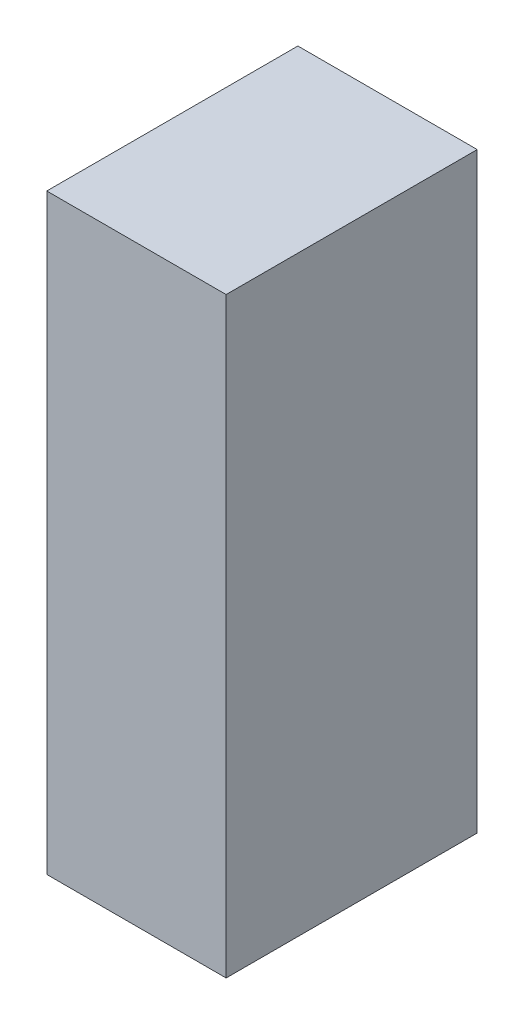
ISO-10303-21;
HEADER;
FILE_DESCRIPTION(('STEP AP214'),'2;1');
FILE_NAME('part.step','',(''),(''),'','','');
FILE_SCHEMA(('AUTOMOTIVE_DESIGN { 1 0 10303 214 1 1 1 1 }'));
ENDSEC;
DATA;
#1=APPLICATION_CONTEXT('core data for automotive mechanical design processes');
#2=APPLICATION_PROTOCOL_DEFINITION('international standard','automotive_design',2000,#1);
#3=PRODUCT_CONTEXT('',#1,'mechanical');
#4=PRODUCT('Part','Part','',(#3));
#5=PRODUCT_RELATED_PRODUCT_CATEGORY('part','',(#4));
#6=PRODUCT_DEFINITION_FORMATION('','',#4);
#7=PRODUCT_DEFINITION_CONTEXT('part definition',#1,'design');
#8=PRODUCT_DEFINITION('design','',#6,#7);
#9=PRODUCT_DEFINITION_SHAPE('','',#8);
#10=(LENGTH_UNIT() NAMED_UNIT(*) SI_UNIT(.MILLI.,.METRE.));
#11=(NAMED_UNIT(*) PLANE_ANGLE_UNIT() SI_UNIT($,.RADIAN.));
#12=(NAMED_UNIT(*) SI_UNIT($,.STERADIAN.) SOLID_ANGLE_UNIT());
#13=UNCERTAINTY_MEASURE_WITH_UNIT(LENGTH_MEASURE(1.E-05),#10,'distance_accuracy_value','');
#14=(GEOMETRIC_REPRESENTATION_CONTEXT(3) GLOBAL_UNCERTAINTY_ASSIGNED_CONTEXT((#13)) GLOBAL_UNIT_ASSIGNED_CONTEXT((#10,
#11,#12)) REPRESENTATION_CONTEXT('',''));
#15=CARTESIAN_POINT('',(0.,0.,0.));
#16=DIRECTION('',(0.,0.,1.));
#17=DIRECTION('',(1.,0.,0.));
#18=AXIS2_PLACEMENT_3D('',#15,#16,#17);
#19=CARTESIAN_POINT('',(-1.62500962696613,-0.825011065223862,-2.84112203121185));
#20=DIRECTION('',(-1.19248806385031E-08,-1.,0.));
#21=DIRECTION('',(1.,-1.19248806385031E-08,0.));
#22=AXIS2_PLACEMENT_3D('',#19,#20,#21);
#23=PLANE('',#22);
#24=DIRECTION('',(1.,-1.19248805337978E-08,0.));
#25=VECTOR('',#24,1.);
#26=CARTESIAN_POINT('',(-1.62500962696613,-0.825011065223862,-2.84112203121185));
#27=LINE('',#26,#25);
#28=CARTESIAN_POINT('',(-1.62500962696613,-0.825011065223862,-2.84112203121185));
#29=VERTEX_POINT('',#28);
#30=CARTESIAN_POINT('',(-1.1250019975716,-0.825011071186395,-2.84112203121185));
#31=VERTEX_POINT('',#30);
#32=EDGE_CURVE('E11',#29,#31,#27,.T.);
#33=ORIENTED_EDGE('',*,*,#32,.T.);
#34=DIRECTION('',(0.,0.,1.));
#35=VECTOR('',#34,1.);
#36=CARTESIAN_POINT('',(-1.1250019975716,-0.825011071186393,-2.84112203121185));
#37=LINE('',#36,#35);
#38=CARTESIAN_POINT('',(-1.1250019975716,-0.825011071186395,-2.14112091064453));
#39=VERTEX_POINT('',#38);
#40=EDGE_CURVE('E88',#31,#39,#37,.T.);
#41=ORIENTED_EDGE('',*,*,#40,.T.);
#42=DIRECTION('',(1.,-1.19248805337978E-08,0.));
#43=VECTOR('',#42,1.);
#44=CARTESIAN_POINT('',(-1.62500962696613,-0.825011065223862,-2.14112091064453));
#45=LINE('',#44,#43);
#46=CARTESIAN_POINT('',(-1.62500962696613,-0.825011065223862,-2.14112091064453));
#47=VERTEX_POINT('',#46);
#48=EDGE_CURVE('E83',#47,#39,#45,.T.);
#49=ORIENTED_EDGE('',*,*,#48,.F.);
#50=DIRECTION('',(0.,0.,1.));
#51=VECTOR('',#50,1.);
#52=CARTESIAN_POINT('',(-1.62500962696613,-0.825011065223861,-2.84112203121185));
#53=LINE('',#52,#51);
#54=EDGE_CURVE('E72',#29,#47,#53,.T.);
#55=ORIENTED_EDGE('',*,*,#54,.F.);
#56=EDGE_LOOP('',(#33,#41,#49,#55));
#57=FACE_BOUND('',#56,.T.);
#58=ADVANCED_FACE('F17',(#57),#23,.T.);
#59=CARTESIAN_POINT('',(-1.1250019975716,-0.825011071186395,-2.84112203121185));
#60=DIRECTION('',(1.,-1.19248806385031E-08,0.));
#61=DIRECTION('',(1.19248806385031E-08,1.,0.));
#62=AXIS2_PLACEMENT_3D('',#59,#60,#61);
#63=PLANE('',#62);
#64=DIRECTION('',(1.19248805831428E-08,1.,0.));
#65=VECTOR('',#64,1.);
#66=CARTESIAN_POINT('',(-1.1250019975716,-0.825011071186395,-2.84112203121185));
#67=LINE('',#66,#65);
#68=CARTESIAN_POINT('',(-1.12500197789562,0.82498282529798,-2.84112203121185));
#69=VERTEX_POINT('',#68);
#70=EDGE_CURVE('E24',#31,#69,#67,.T.);
#71=ORIENTED_EDGE('',*,*,#70,.T.);
#72=DIRECTION('',(0.,0.,1.));
#73=VECTOR('',#72,1.);
#74=CARTESIAN_POINT('',(-1.12500197789562,0.824982825297979,-2.84112203121185));
#75=LINE('',#74,#73);
#76=CARTESIAN_POINT('',(-1.12500197789562,0.82498282529798,-2.14112091064453));
#77=VERTEX_POINT('',#76);
#78=EDGE_CURVE('E85',#69,#77,#75,.T.);
#79=ORIENTED_EDGE('',*,*,#78,.T.);
#80=DIRECTION('',(1.19248805831428E-08,1.,0.));
#81=VECTOR('',#80,1.);
#82=CARTESIAN_POINT('',(-1.1250019975716,-0.825011071186395,-2.14112091064453));
#83=LINE('',#82,#81);
#84=EDGE_CURVE('E66',#39,#77,#83,.T.);
#85=ORIENTED_EDGE('',*,*,#84,.F.);
#86=ORIENTED_EDGE('',*,*,#40,.F.);
#87=EDGE_LOOP('',(#71,#79,#85,#86));
#88=FACE_BOUND('',#87,.T.);
#89=ADVANCED_FACE('F89',(#88),#63,.T.);
#90=CARTESIAN_POINT('',(-1.12500197789562,0.82498282529798,-2.84112203121185));
#91=DIRECTION('',(1.19248806385031E-08,1.,0.));
#92=DIRECTION('',(-1.,1.19248806385031E-08,0.));
#93=AXIS2_PLACEMENT_3D('',#90,#91,#92);
#94=PLANE('',#93);
#95=DIRECTION('',(-1.,1.19248805337978E-08,0.));
#96=VECTOR('',#95,1.);
#97=CARTESIAN_POINT('',(-1.12500197789562,0.82498282529798,-2.84112203121185));
#98=LINE('',#97,#96);
#99=CARTESIAN_POINT('',(-1.62500960729015,0.824982831260513,-2.84112203121185));
#100=VERTEX_POINT('',#99);
#101=EDGE_CURVE('E62',#69,#100,#98,.T.);
#102=ORIENTED_EDGE('',*,*,#101,.T.);
#103=DIRECTION('',(0.,0.,1.));
#104=VECTOR('',#103,1.);
#105=CARTESIAN_POINT('',(-1.62500960729015,0.824982831260511,-2.84112203121185));
#106=LINE('',#105,#104);
#107=CARTESIAN_POINT('',(-1.62500960729015,0.824982831260513,-2.14112091064453));
#108=VERTEX_POINT('',#107);
#109=EDGE_CURVE('E55',#100,#108,#106,.T.);
#110=ORIENTED_EDGE('',*,*,#109,.T.);
#111=DIRECTION('',(-1.,1.19248805337978E-08,0.));
#112=VECTOR('',#111,1.);
#113=CARTESIAN_POINT('',(-1.12500197789562,0.82498282529798,-2.14112091064453));
#114=LINE('',#113,#112);
#115=EDGE_CURVE('E59',#77,#108,#114,.T.);
#116=ORIENTED_EDGE('',*,*,#115,.F.);
#117=ORIENTED_EDGE('',*,*,#78,.F.);
#118=EDGE_LOOP('',(#102,#110,#116,#117));
#119=FACE_BOUND('',#118,.T.);
#120=ADVANCED_FACE('F57',(#119),#94,.T.);
#121=CARTESIAN_POINT('',(-1.62500960729015,0.824982831260513,-2.84112203121185));
#122=DIRECTION('',(-1.,1.19248806385031E-08,0.));
#123=DIRECTION('',(-1.19248806385031E-08,-1.,0.));
#124=AXIS2_PLACEMENT_3D('',#121,#122,#123);
#125=PLANE('',#124);
#126=DIRECTION('',(-1.19248805831428E-08,-1.,0.));
#127=VECTOR('',#126,1.);
#128=CARTESIAN_POINT('',(-1.62500960729015,0.824982831260513,-2.84112203121185));
#129=LINE('',#128,#127);
#130=EDGE_CURVE('E65',#100,#29,#129,.T.);
#131=ORIENTED_EDGE('',*,*,#130,.T.);
#132=ORIENTED_EDGE('',*,*,#54,.T.);
#133=DIRECTION('',(-1.19248805831428E-08,-1.,0.));
#134=VECTOR('',#133,1.);
#135=CARTESIAN_POINT('',(-1.62500960729015,0.824982831260513,-2.14112091064453));
#136=LINE('',#135,#134);
#137=EDGE_CURVE('E70',#108,#47,#136,.T.);
#138=ORIENTED_EDGE('',*,*,#137,.F.);
#139=ORIENTED_EDGE('',*,*,#109,.F.);
#140=EDGE_LOOP('',(#131,#132,#138,#139));
#141=FACE_BOUND('',#140,.T.);
#142=ADVANCED_FACE('F71',(#141),#125,.T.);
#143=CARTESIAN_POINT('',(94.1249923706055,-473.100006103516,-2.14112091064453));
#144=DIRECTION('',(0.,0.,1.));
#145=DIRECTION('',(1.19248806385031E-08,1.,0.));
#146=AXIS2_PLACEMENT_3D('',#143,#144,#145);
#147=PLANE('',#146);
#148=ORIENTED_EDGE('',*,*,#48,.T.);
#149=ORIENTED_EDGE('',*,*,#84,.T.);
#150=ORIENTED_EDGE('',*,*,#115,.T.);
#151=ORIENTED_EDGE('',*,*,#137,.T.);
#152=EDGE_LOOP('',(#148,#149,#150,#151));
#153=FACE_BOUND('',#152,.T.);
#154=ADVANCED_FACE('F76',(#153),#147,.T.);
#155=CARTESIAN_POINT('',(94.1249923706055,-473.100006103516,-2.84112203121185));
#156=DIRECTION('',(0.,0.,1.));
#157=DIRECTION('',(1.19248806385031E-08,1.,0.));
#158=AXIS2_PLACEMENT_3D('',#155,#156,#157);
#159=PLANE('',#158);
#160=ORIENTED_EDGE('',*,*,#130,.F.);
#161=ORIENTED_EDGE('',*,*,#101,.F.);
#162=ORIENTED_EDGE('',*,*,#70,.F.);
#163=ORIENTED_EDGE('',*,*,#32,.F.);
#164=EDGE_LOOP('',(#160,#161,#162,#163));
#165=FACE_BOUND('',#164,.T.);
#166=ADVANCED_FACE('F91',(#165),#159,.F.);
#167=CLOSED_SHELL('',(#58,#89,#120,#142,#154,#166));
#168=MANIFOLD_SOLID_BREP('B1',#167);
#169=ADVANCED_BREP_SHAPE_REPRESENTATION('',(#18,#168),#14);
#170=SHAPE_DEFINITION_REPRESENTATION(#9,#169);
ENDSEC;
END-ISO-10303-21;
